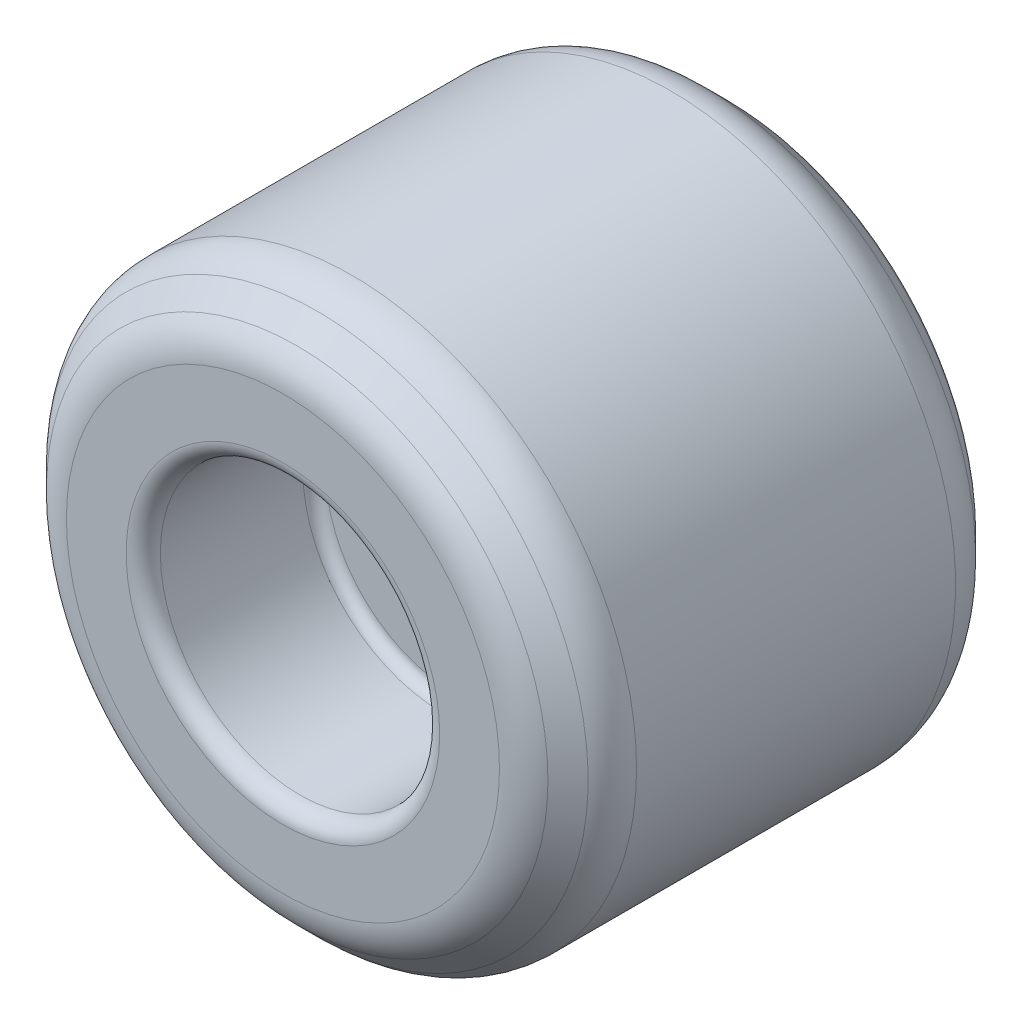
ISO-10303-21;
HEADER;
FILE_DESCRIPTION(('STEP AP214'),'2;1');
FILE_NAME('part.step','',(''),(''),'','','');
FILE_SCHEMA(('AUTOMOTIVE_DESIGN { 1 0 10303 214 1 1 1 1 }'));
ENDSEC;
DATA;
#1=APPLICATION_CONTEXT('core data for automotive mechanical design processes');
#2=APPLICATION_PROTOCOL_DEFINITION('international standard','automotive_design',2000,#1);
#3=PRODUCT_CONTEXT('',#1,'mechanical');
#4=PRODUCT('Part','Part','',(#3));
#5=PRODUCT_RELATED_PRODUCT_CATEGORY('part','',(#4));
#6=PRODUCT_DEFINITION_FORMATION('','',#4);
#7=PRODUCT_DEFINITION_CONTEXT('part definition',#1,'design');
#8=PRODUCT_DEFINITION('design','',#6,#7);
#9=PRODUCT_DEFINITION_SHAPE('','',#8);
#10=(LENGTH_UNIT() NAMED_UNIT(*) SI_UNIT(.MILLI.,.METRE.));
#11=(NAMED_UNIT(*) PLANE_ANGLE_UNIT() SI_UNIT($,.RADIAN.));
#12=(NAMED_UNIT(*) SI_UNIT($,.STERADIAN.) SOLID_ANGLE_UNIT());
#13=UNCERTAINTY_MEASURE_WITH_UNIT(LENGTH_MEASURE(1.E-05),#10,'distance_accuracy_value','');
#14=(GEOMETRIC_REPRESENTATION_CONTEXT(3) GLOBAL_UNCERTAINTY_ASSIGNED_CONTEXT((#13)) GLOBAL_UNIT_ASSIGNED_CONTEXT((#10,
#11,#12)) REPRESENTATION_CONTEXT('',''));
#15=CARTESIAN_POINT('',(0.,0.,0.));
#16=DIRECTION('',(0.,0.,1.));
#17=DIRECTION('',(1.,0.,0.));
#18=AXIS2_PLACEMENT_3D('',#15,#16,#17);
#19=CARTESIAN_POINT('',(0.,0.,10.16));
#20=DIRECTION('',(0.,0.,-1.));
#21=DIRECTION('',(-1.,0.,0.));
#22=AXIS2_PLACEMENT_3D('',#19,#20,#21);
#23=CYLINDRICAL_SURFACE('',#22,6.35);
#24=CARTESIAN_POINT('',(0.,0.,8.63335645941824));
#25=DIRECTION('',(0.,0.,1.));
#26=DIRECTION('',(1.,0.,0.));
#27=AXIS2_PLACEMENT_3D('',#24,#25,#26);
#28=CIRCLE('',#27,6.35);
#29=CARTESIAN_POINT('',(6.35,0.,8.63335645941824));
#30=VERTEX_POINT('',#29);
#31=EDGE_CURVE('E57',#30,#30,#28,.F.);
#32=ORIENTED_EDGE('',*,*,#31,.T.);
#33=EDGE_LOOP('',(#32));
#34=FACE_BOUND('',#33,.T.);
#35=CARTESIAN_POINT('',(0.,0.,1.52664354058175));
#36=DIRECTION('',(0.,0.,-1.));
#37=DIRECTION('',(-1.,0.,0.));
#38=AXIS2_PLACEMENT_3D('',#35,#36,#37);
#39=CIRCLE('',#38,6.35);
#40=CARTESIAN_POINT('',(-6.35,0.,1.52664354058175));
#41=VERTEX_POINT('',#40);
#42=EDGE_CURVE('E63',#41,#41,#39,.F.);
#43=ORIENTED_EDGE('',*,*,#42,.T.);
#44=EDGE_LOOP('',(#43));
#45=FACE_BOUND('',#44,.T.);
#46=ADVANCED_FACE('F39',(#34,#45),#23,.T.);
#47=CARTESIAN_POINT('',(0.,0.,10.16));
#48=DIRECTION('',(0.,0.,1.));
#49=DIRECTION('',(1.,0.,0.));
#50=AXIS2_PLACEMENT_3D('',#47,#48,#49);
#51=PLANE('',#50);
#52=CARTESIAN_POINT('',(0.,0.,10.16));
#53=DIRECTION('',(0.,0.,1.));
#54=DIRECTION('',(1.,0.,0.));
#55=AXIS2_PLACEMENT_3D('',#52,#53,#54);
#56=CIRCLE('',#55,4.82335645941824);
#57=CARTESIAN_POINT('',(4.82335645941824,0.,10.16));
#58=VERTEX_POINT('',#57);
#59=EDGE_CURVE('E75',#58,#58,#56,.T.);
#60=ORIENTED_EDGE('',*,*,#59,.T.);
#61=EDGE_LOOP('',(#60));
#62=FACE_BOUND('',#61,.T.);
#63=CARTESIAN_POINT('',(0.,0.,10.16));
#64=DIRECTION('',(0.,0.,1.));
#65=DIRECTION('',(1.,0.,0.));
#66=AXIS2_PLACEMENT_3D('',#63,#64,#65);
#67=CIRCLE('',#66,3.4925);
#68=CARTESIAN_POINT('',(3.4925,0.,10.16));
#69=VERTEX_POINT('',#68);
#70=EDGE_CURVE('E79',#69,#69,#67,.F.);
#71=ORIENTED_EDGE('',*,*,#70,.T.);
#72=EDGE_LOOP('',(#71));
#73=FACE_BOUND('',#72,.T.);
#74=ADVANCED_FACE('F132',(#62,#73),#51,.T.);
#75=CARTESIAN_POINT('',(0.,0.,0.));
#76=DIRECTION('',(0.,0.,1.));
#77=DIRECTION('',(1.,0.,0.));
#78=AXIS2_PLACEMENT_3D('',#75,#76,#77);
#79=PLANE('',#78);
#80=CARTESIAN_POINT('',(0.,0.,0.));
#81=DIRECTION('',(0.,0.,1.));
#82=DIRECTION('',(1.,0.,0.));
#83=AXIS2_PLACEMENT_3D('',#80,#81,#82);
#84=CIRCLE('',#83,4.82335645941825);
#85=CARTESIAN_POINT('',(4.82335645941825,0.,0.));
#86=VERTEX_POINT('',#85);
#87=EDGE_CURVE('E10',#86,#86,#84,.F.);
#88=ORIENTED_EDGE('',*,*,#87,.T.);
#89=EDGE_LOOP('',(#88));
#90=FACE_BOUND('',#89,.T.);
#91=CARTESIAN_POINT('',(0.,0.,0.));
#92=DIRECTION('',(0.,0.,1.));
#93=DIRECTION('',(1.,0.,0.));
#94=AXIS2_PLACEMENT_3D('',#91,#92,#93);
#95=CIRCLE('',#94,3.4925);
#96=CARTESIAN_POINT('',(3.4925,0.,0.));
#97=VERTEX_POINT('',#96);
#98=EDGE_CURVE('E91',#97,#97,#95,.T.);
#99=ORIENTED_EDGE('',*,*,#98,.T.);
#100=EDGE_LOOP('',(#99));
#101=FACE_BOUND('',#100,.T.);
#102=ADVANCED_FACE('F138',(#90,#101),#79,.F.);
#103=CARTESIAN_POINT('',(0.,0.,6.35));
#104=DIRECTION('',(0.,0.,1.));
#105=DIRECTION('',(1.,0.,0.));
#106=AXIS2_PLACEMENT_3D('',#103,#104,#105);
#107=CYLINDRICAL_SURFACE('',#106,3.1115);
#108=CARTESIAN_POINT('',(0.,0.,9.779));
#109=DIRECTION('',(0.,0.,1.));
#110=DIRECTION('',(1.,0.,0.));
#111=AXIS2_PLACEMENT_3D('',#108,#109,#110);
#112=CIRCLE('',#111,3.1115);
#113=CARTESIAN_POINT('',(3.1115,0.,9.779));
#114=VERTEX_POINT('',#113);
#115=EDGE_CURVE('E83',#114,#114,#112,.T.);
#116=ORIENTED_EDGE('',*,*,#115,.T.);
#117=EDGE_LOOP('',(#116));
#118=FACE_BOUND('',#117,.T.);
#119=CARTESIAN_POINT('',(0.,0.,6.604));
#120=DIRECTION('',(0.,0.,1.));
#121=DIRECTION('',(1.,0.,0.));
#122=AXIS2_PLACEMENT_3D('',#119,#120,#121);
#123=CIRCLE('',#122,3.1115);
#124=CARTESIAN_POINT('',(3.1115,0.,6.604));
#125=VERTEX_POINT('',#124);
#126=EDGE_CURVE('E103',#125,#125,#123,.F.);
#127=ORIENTED_EDGE('',*,*,#126,.T.);
#128=EDGE_LOOP('',(#127));
#129=FACE_BOUND('',#128,.T.);
#130=ADVANCED_FACE('F193',(#118,#129),#107,.F.);
#131=CARTESIAN_POINT('',(0.,0.,6.35));
#132=DIRECTION('',(0.,0.,1.));
#133=DIRECTION('',(1.,0.,0.));
#134=AXIS2_PLACEMENT_3D('',#131,#132,#133);
#135=PLANE('',#134);
#136=CARTESIAN_POINT('',(0.,0.,6.35));
#137=DIRECTION('',(0.,0.,1.));
#138=DIRECTION('',(1.,0.,0.));
#139=AXIS2_PLACEMENT_3D('',#136,#137,#138);
#140=CIRCLE('',#139,2.8575);
#141=CARTESIAN_POINT('',(2.8575,0.,6.35));
#142=VERTEX_POINT('',#141);
#143=EDGE_CURVE('E107',#142,#142,#140,.T.);
#144=ORIENTED_EDGE('',*,*,#143,.T.);
#145=EDGE_LOOP('',(#144));
#146=FACE_BOUND('',#145,.T.);
#147=ADVANCED_FACE('F112',(#146),#135,.T.);
#148=CARTESIAN_POINT('',(0.,0.,3.81));
#149=DIRECTION('',(0.,0.,-1.));
#150=DIRECTION('',(-1.,0.,0.));
#151=AXIS2_PLACEMENT_3D('',#148,#149,#150);
#152=CYLINDRICAL_SURFACE('',#151,3.1115);
#153=CARTESIAN_POINT('',(0.,0.,0.381));
#154=DIRECTION('',(0.,0.,1.));
#155=DIRECTION('',(1.,0.,0.));
#156=AXIS2_PLACEMENT_3D('',#153,#154,#155);
#157=CIRCLE('',#156,3.1115);
#158=CARTESIAN_POINT('',(3.1115,0.,0.381));
#159=VERTEX_POINT('',#158);
#160=EDGE_CURVE('E87',#159,#159,#157,.F.);
#161=ORIENTED_EDGE('',*,*,#160,.T.);
#162=EDGE_LOOP('',(#161));
#163=FACE_BOUND('',#162,.T.);
#164=CARTESIAN_POINT('',(0.,0.,3.556));
#165=DIRECTION('',(0.,0.,-1.));
#166=DIRECTION('',(-1.,0.,0.));
#167=AXIS2_PLACEMENT_3D('',#164,#165,#166);
#168=CIRCLE('',#167,3.1115);
#169=CARTESIAN_POINT('',(-3.1115,0.,3.556));
#170=VERTEX_POINT('',#169);
#171=EDGE_CURVE('E99',#170,#170,#168,.F.);
#172=ORIENTED_EDGE('',*,*,#171,.T.);
#173=EDGE_LOOP('',(#172));
#174=FACE_BOUND('',#173,.T.);
#175=ADVANCED_FACE('F155',(#163,#174),#152,.F.);
#176=CARTESIAN_POINT('',(0.,0.,3.81));
#177=DIRECTION('',(0.,0.,-1.));
#178=DIRECTION('',(1.,0.,0.));
#179=AXIS2_PLACEMENT_3D('',#176,#177,#178);
#180=PLANE('',#179);
#181=CARTESIAN_POINT('',(0.,0.,3.81));
#182=DIRECTION('',(0.,0.,-1.));
#183=DIRECTION('',(-1.,0.,0.));
#184=AXIS2_PLACEMENT_3D('',#181,#182,#183);
#185=CIRCLE('',#184,2.8575);
#186=CARTESIAN_POINT('',(-2.8575,0.,3.81));
#187=VERTEX_POINT('',#186);
#188=EDGE_CURVE('E95',#187,#187,#185,.T.);
#189=ORIENTED_EDGE('',*,*,#188,.T.);
#190=EDGE_LOOP('',(#189));
#191=FACE_BOUND('',#190,.T.);
#192=ADVANCED_FACE('F149',(#191),#180,.T.);
#193=CARTESIAN_POINT('',(0.,0.,1.0795));
#194=DIRECTION('',(0.,0.,1.));
#195=DIRECTION('',(1.,0.,0.));
#196=AXIS2_PLACEMENT_3D('',#193,#194,#195);
#197=CONICAL_SURFACE('',#196,6.35,0.78539816339745);
#198=CARTESIAN_POINT('',(0.,0.,0.763321770290873));
#199=DIRECTION('',(0.,0.,1.));
#200=DIRECTION('',(1.,0.,0.));
#201=AXIS2_PLACEMENT_3D('',#198,#199,#200);
#202=CIRCLE('',#201,6.03382177029088);
#203=CARTESIAN_POINT('',(6.03382177029088,0.,0.763321770290873));
#204=VERTEX_POINT('',#203);
#205=EDGE_CURVE('E47',#204,#204,#202,.F.);
#206=ORIENTED_EDGE('',*,*,#205,.T.);
#207=EDGE_LOOP('',(#206));
#208=FACE_BOUND('',#207,.T.);
#209=CARTESIAN_POINT('',(0.,0.,0.31617822970912));
#210=DIRECTION('',(0.,0.,1.));
#211=DIRECTION('',(1.,0.,0.));
#212=AXIS2_PLACEMENT_3D('',#209,#210,#211);
#213=CIRCLE('',#212,5.58667822970912);
#214=CARTESIAN_POINT('',(5.58667822970912,0.,0.31617822970912));
#215=VERTEX_POINT('',#214);
#216=EDGE_CURVE('E52',#215,#215,#213,.T.);
#217=ORIENTED_EDGE('',*,*,#216,.T.);
#218=EDGE_LOOP('',(#217));
#219=FACE_BOUND('',#218,.T.);
#220=ADVANCED_FACE('F127',(#208,#219),#197,.T.);
#221=CARTESIAN_POINT('',(0.,0.,10.16));
#222=DIRECTION('',(0.,0.,-1.));
#223=DIRECTION('',(-1.,0.,0.));
#224=AXIS2_PLACEMENT_3D('',#221,#222,#223);
#225=CONICAL_SURFACE('',#224,5.27049999999999,0.785398163397448);
#226=CARTESIAN_POINT('',(0.,0.,9.84382177029087));
#227=DIRECTION('',(0.,0.,1.));
#228=DIRECTION('',(1.,0.,0.));
#229=AXIS2_PLACEMENT_3D('',#226,#227,#228);
#230=CIRCLE('',#229,5.58667822970912);
#231=CARTESIAN_POINT('',(5.58667822970912,0.,9.84382177029087));
#232=VERTEX_POINT('',#231);
#233=EDGE_CURVE('E67',#232,#232,#230,.F.);
#234=ORIENTED_EDGE('',*,*,#233,.T.);
#235=EDGE_LOOP('',(#234));
#236=FACE_BOUND('',#235,.T.);
#237=CARTESIAN_POINT('',(0.,0.,9.39667822970912));
#238=DIRECTION('',(0.,0.,-1.));
#239=DIRECTION('',(-1.,0.,0.));
#240=AXIS2_PLACEMENT_3D('',#237,#238,#239);
#241=CIRCLE('',#240,6.03382177029088);
#242=CARTESIAN_POINT('',(-6.03382177029088,0.,9.39667822970912));
#243=VERTEX_POINT('',#242);
#244=EDGE_CURVE('E71',#243,#243,#241,.F.);
#245=ORIENTED_EDGE('',*,*,#244,.T.);
#246=EDGE_LOOP('',(#245));
#247=FACE_BOUND('',#246,.T.);
#248=ADVANCED_FACE('F117',(#236,#247),#225,.T.);
#249=CARTESIAN_POINT('',(0.,0.,6.604));
#250=DIRECTION('',(0.,0.,1.));
#251=DIRECTION('',(1.,0.,0.));
#252=AXIS2_PLACEMENT_3D('',#249,#250,#251);
#253=TOROIDAL_SURFACE('',#252,2.8575,0.254);
#254=ORIENTED_EDGE('',*,*,#126,.F.);
#255=EDGE_LOOP('',(#254));
#256=FACE_BOUND('',#255,.T.);
#257=ORIENTED_EDGE('',*,*,#143,.F.);
#258=EDGE_LOOP('',(#257));
#259=FACE_BOUND('',#258,.T.);
#260=ADVANCED_FACE('F114',(#256,#259),#253,.F.);
#261=CARTESIAN_POINT('',(0.,0.,3.556));
#262=DIRECTION('',(0.,0.,-1.));
#263=DIRECTION('',(-1.,0.,0.));
#264=AXIS2_PLACEMENT_3D('',#261,#262,#263);
#265=TOROIDAL_SURFACE('',#264,2.8575,0.254);
#266=ORIENTED_EDGE('',*,*,#188,.F.);
#267=EDGE_LOOP('',(#266));
#268=FACE_BOUND('',#267,.T.);
#269=ORIENTED_EDGE('',*,*,#171,.F.);
#270=EDGE_LOOP('',(#269));
#271=FACE_BOUND('',#270,.T.);
#272=ADVANCED_FACE('F116',(#268,#271),#265,.F.);
#273=CARTESIAN_POINT('',(0.,0.,0.381));
#274=DIRECTION('',(0.,0.,1.));
#275=DIRECTION('',(1.,0.,0.));
#276=AXIS2_PLACEMENT_3D('',#273,#274,#275);
#277=TOROIDAL_SURFACE('',#276,3.4925,0.381);
#278=ORIENTED_EDGE('',*,*,#160,.F.);
#279=EDGE_LOOP('',(#278));
#280=FACE_BOUND('',#279,.T.);
#281=ORIENTED_EDGE('',*,*,#98,.F.);
#282=EDGE_LOOP('',(#281));
#283=FACE_BOUND('',#282,.T.);
#284=ADVANCED_FACE('F124',(#280,#283),#277,.T.);
#285=CARTESIAN_POINT('',(0.,0.,9.779));
#286=DIRECTION('',(0.,0.,1.));
#287=DIRECTION('',(1.,0.,0.));
#288=AXIS2_PLACEMENT_3D('',#285,#286,#287);
#289=TOROIDAL_SURFACE('',#288,3.4925,0.381);
#290=ORIENTED_EDGE('',*,*,#70,.F.);
#291=EDGE_LOOP('',(#290));
#292=FACE_BOUND('',#291,.T.);
#293=ORIENTED_EDGE('',*,*,#115,.F.);
#294=EDGE_LOOP('',(#293));
#295=FACE_BOUND('',#294,.T.);
#296=ADVANCED_FACE('F179',(#292,#295),#289,.T.);
#297=CARTESIAN_POINT('',(0.,0.,9.0805));
#298=DIRECTION('',(0.,0.,1.));
#299=DIRECTION('',(1.,0.,0.));
#300=AXIS2_PLACEMENT_3D('',#297,#298,#299);
#301=TOROIDAL_SURFACE('',#300,4.82335645941824,1.0795);
#302=ORIENTED_EDGE('',*,*,#233,.F.);
#303=EDGE_LOOP('',(#302));
#304=FACE_BOUND('',#303,.T.);
#305=ORIENTED_EDGE('',*,*,#59,.F.);
#306=EDGE_LOOP('',(#305));
#307=FACE_BOUND('',#306,.T.);
#308=ADVANCED_FACE('F172',(#304,#307),#301,.T.);
#309=CARTESIAN_POINT('',(0.,0.,8.63335645941824));
#310=DIRECTION('',(0.,0.,1.));
#311=DIRECTION('',(1.,0.,0.));
#312=AXIS2_PLACEMENT_3D('',#309,#310,#311);
#313=TOROIDAL_SURFACE('',#312,5.2705,1.0795);
#314=ORIENTED_EDGE('',*,*,#244,.F.);
#315=EDGE_LOOP('',(#314));
#316=FACE_BOUND('',#315,.T.);
#317=ORIENTED_EDGE('',*,*,#31,.F.);
#318=EDGE_LOOP('',(#317));
#319=FACE_BOUND('',#318,.T.);
#320=ADVANCED_FACE('F167',(#316,#319),#313,.T.);
#321=CARTESIAN_POINT('',(0.,0.,1.52664354058175));
#322=DIRECTION('',(0.,0.,-1.));
#323=DIRECTION('',(-1.,0.,0.));
#324=AXIS2_PLACEMENT_3D('',#321,#322,#323);
#325=TOROIDAL_SURFACE('',#324,5.2705,1.0795);
#326=ORIENTED_EDGE('',*,*,#205,.F.);
#327=EDGE_LOOP('',(#326));
#328=FACE_BOUND('',#327,.T.);
#329=ORIENTED_EDGE('',*,*,#42,.F.);
#330=EDGE_LOOP('',(#329));
#331=FACE_BOUND('',#330,.T.);
#332=ADVANCED_FACE('F163',(#328,#331),#325,.T.);
#333=CARTESIAN_POINT('',(0.,0.,1.0795));
#334=DIRECTION('',(0.,0.,1.));
#335=DIRECTION('',(1.,0.,0.));
#336=AXIS2_PLACEMENT_3D('',#333,#334,#335);
#337=TOROIDAL_SURFACE('',#336,4.82335645941825,1.0795);
#338=ORIENTED_EDGE('',*,*,#216,.F.);
#339=EDGE_LOOP('',(#338));
#340=FACE_BOUND('',#339,.T.);
#341=ORIENTED_EDGE('',*,*,#87,.F.);
#342=EDGE_LOOP('',(#341));
#343=FACE_BOUND('',#342,.T.);
#344=ADVANCED_FACE('F41',(#340,#343),#337,.T.);
#345=CLOSED_SHELL('',(#46,#74,#102,#130,#147,#175,#192,#220,#248,#260,#272,#284,#296,#308,#320,
#332,#344));
#346=MANIFOLD_SOLID_BREP('B2',#345);
#347=ADVANCED_BREP_SHAPE_REPRESENTATION('',(#18,#346),#14);
#348=SHAPE_DEFINITION_REPRESENTATION(#9,#347);
ENDSEC;
END-ISO-10303-21;
